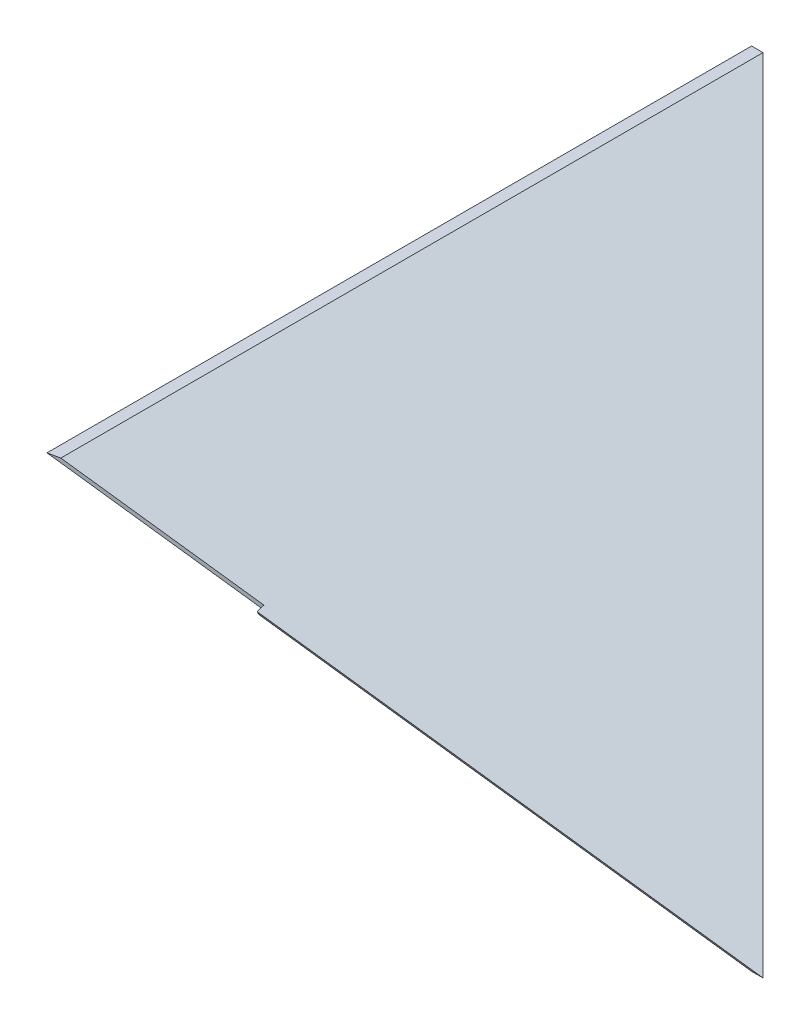
ISO-10303-21;
HEADER;
FILE_DESCRIPTION(('STEP AP214'),'2;1');
FILE_NAME('part.step','',(''),(''),'','','');
FILE_SCHEMA(('AUTOMOTIVE_DESIGN { 1 0 10303 214 1 1 1 1 }'));
ENDSEC;
DATA;
#1=APPLICATION_CONTEXT('core data for automotive mechanical design processes');
#2=APPLICATION_PROTOCOL_DEFINITION('international standard','automotive_design',2000,#1);
#3=PRODUCT_CONTEXT('',#1,'mechanical');
#4=PRODUCT('Part','Part','',(#3));
#5=PRODUCT_RELATED_PRODUCT_CATEGORY('part','',(#4));
#6=PRODUCT_DEFINITION_FORMATION('','',#4);
#7=PRODUCT_DEFINITION_CONTEXT('part definition',#1,'design');
#8=PRODUCT_DEFINITION('design','',#6,#7);
#9=PRODUCT_DEFINITION_SHAPE('','',#8);
#10=(LENGTH_UNIT() NAMED_UNIT(*) SI_UNIT(.MILLI.,.METRE.));
#11=(NAMED_UNIT(*) PLANE_ANGLE_UNIT() SI_UNIT($,.RADIAN.));
#12=(NAMED_UNIT(*) SI_UNIT($,.STERADIAN.) SOLID_ANGLE_UNIT());
#13=UNCERTAINTY_MEASURE_WITH_UNIT(LENGTH_MEASURE(1.E-05),#10,'distance_accuracy_value','');
#14=(GEOMETRIC_REPRESENTATION_CONTEXT(3) GLOBAL_UNCERTAINTY_ASSIGNED_CONTEXT((#13)) GLOBAL_UNIT_ASSIGNED_CONTEXT((#10,
#11,#12)) REPRESENTATION_CONTEXT('',''));
#15=CARTESIAN_POINT('',(0.,0.,0.));
#16=DIRECTION('',(0.,0.,1.));
#17=DIRECTION('',(1.,0.,0.));
#18=AXIS2_PLACEMENT_3D('',#15,#16,#17);
#19=CARTESIAN_POINT('',(304.8,-59.3053290170354,162.940052327635));
#20=DIRECTION('',(0.,0.939692620785911,0.342020143325663));
#21=DIRECTION('',(0.,-0.342020143325663,0.939692620785911));
#22=AXIS2_PLACEMENT_3D('',#19,#20,#21);
#23=PLANE('',#22);
#24=DIRECTION('',(-1.,0.,0.));
#25=VECTOR('',#24,1.);
#26=CARTESIAN_POINT('',(304.8,0.,0.));
#27=LINE('',#26,#25);
#28=CARTESIAN_POINT('',(3.17500000000007,0.,-6.E-06));
#29=VERTEX_POINT('',#28);
#30=CARTESIAN_POINT('',(0.,0.,0.));
#31=VERTEX_POINT('',#30);
#32=EDGE_CURVE('E104',#29,#31,#27,.T.);
#33=ORIENTED_EDGE('',*,*,#32,.F.);
#34=DIRECTION('',(0.684791078771737,-0.24924356936395,0.684791078771736));
#35=VECTOR('',#34,1.);
#36=CARTESIAN_POINT('',(231.149808257967,-82.9760443684434,227.974808257967));
#37=LINE('',#36,#35);
#38=CARTESIAN_POINT('',(166.115052327635,-59.3053290170354,162.940052327635));
#39=VERTEX_POINT('',#38);
#40=EDGE_CURVE('E106',#29,#39,#37,.T.);
#41=ORIENTED_EDGE('',*,*,#40,.T.);
#42=DIRECTION('',(-1.,0.,0.));
#43=VECTOR('',#42,1.);
#44=CARTESIAN_POINT('',(304.8,-59.3053290170354,162.940052327635));
#45=LINE('',#44,#43);
#46=CARTESIAN_POINT('',(162.940052327635,-59.3053290170354,162.940052327635));
#47=VERTEX_POINT('',#46);
#48=EDGE_CURVE('E105',#39,#47,#45,.T.);
#49=ORIENTED_EDGE('',*,*,#48,.T.);
#50=DIRECTION('',(-0.684791078771737,0.24924356936395,-0.684791078771736));
#51=VECTOR('',#50,1.);
#52=CARTESIAN_POINT('',(229.463689016437,-83.5179526468981,229.463689016437));
#53=LINE('',#52,#51);
#54=EDGE_CURVE('E110',#47,#31,#53,.T.);
#55=ORIENTED_EDGE('',*,*,#54,.T.);
#56=EDGE_LOOP('',(#33,#41,#49,#55));
#57=FACE_BOUND('',#56,.T.);
#58=ADVANCED_FACE('F34',(#57),#23,.F.);
#59=CARTESIAN_POINT('',(304.8,0.,0.));
#60=DIRECTION('',(0.,-1.,0.));
#61=DIRECTION('',(0.,0.,-1.));
#62=AXIS2_PLACEMENT_3D('',#59,#60,#61);
#63=PLANE('',#62);
#64=DIRECTION('',(0.,0.,1.));
#65=VECTOR('',#64,1.);
#66=CARTESIAN_POINT('',(0.,0.,0.));
#67=LINE('',#66,#65);
#68=CARTESIAN_POINT('',(0.,0.,195.413931332238));
#69=VERTEX_POINT('',#68);
#70=EDGE_CURVE('E95',#31,#69,#67,.T.);
#71=ORIENTED_EDGE('',*,*,#70,.T.);
#72=DIRECTION('',(-0.978626263746878,0.,0.205646871857623));
#73=VECTOR('',#72,1.);
#74=CARTESIAN_POINT('',(49.7142141983414,0.,184.967070241871));
#75=LINE('',#74,#73);
#76=CARTESIAN_POINT('',(3.17499999999987,0.,194.746742189319));
#77=VERTEX_POINT('',#76);
#78=EDGE_CURVE('E80',#77,#69,#75,.T.);
#79=ORIENTED_EDGE('',*,*,#78,.F.);
#80=DIRECTION('',(0.,0.,-1.));
#81=VECTOR('',#80,1.);
#82=CARTESIAN_POINT('',(3.17500000000007,0.,197.18));
#83=LINE('',#82,#81);
#84=EDGE_CURVE('E99',#77,#29,#83,.T.);
#85=ORIENTED_EDGE('',*,*,#84,.T.);
#86=ORIENTED_EDGE('',*,*,#32,.T.);
#87=EDGE_LOOP('',(#71,#79,#85,#86));
#88=FACE_BOUND('',#87,.T.);
#89=ADVANCED_FACE('F102',(#88),#63,.F.);
#90=CARTESIAN_POINT('',(304.8,0.,197.18));
#91=DIRECTION('',(0.,0.500000000000004,-0.866025403784436));
#92=DIRECTION('',(0.,0.866025403784436,0.500000000000005));
#93=AXIS2_PLACEMENT_3D('',#90,#91,#92);
#94=PLANE('',#93);
#95=DIRECTION('',(-0.92189103304376,0.335540895264842,0.193724626205287));
#96=VECTOR('',#95,1.);
#97=CARTESIAN_POINT('',(259.520983041758,-93.3023075009067,143.311887648338));
#98=LINE('',#97,#96);
#99=CARTESIAN_POINT('',(50.2039108119524,-17.1171236855104,187.297424032418));
#100=VERTEX_POINT('',#99);
#101=EDGE_CURVE('E55',#39,#100,#98,.T.);
#102=ORIENTED_EDGE('',*,*,#101,.T.);
#103=DIRECTION('',(-0.104493957523866,-0.861284366298812,-0.497262760731441));
#104=VECTOR('',#103,1.);
#105=CARTESIAN_POINT('',(55.0378745335579,22.7264948292113,210.301147907382));
#106=LINE('',#105,#104);
#107=CARTESIAN_POINT('',(50.0696380429546,-18.2238578881178,186.658450742622));
#108=VERTEX_POINT('',#107);
#109=EDGE_CURVE('E48',#100,#108,#106,.T.);
#110=ORIENTED_EDGE('',*,*,#109,.T.);
#111=DIRECTION('',(0.92189103304376,-0.335540895264842,-0.193724626205287));
#112=VECTOR('',#111,1.);
#113=CARTESIAN_POINT('',(259.044361810618,-94.2844370535478,142.744854886741));
#114=LINE('',#113,#112);
#115=EDGE_CURVE('E120',#108,#47,#114,.T.);
#116=ORIENTED_EDGE('',*,*,#115,.T.);
#117=ORIENTED_EDGE('',*,*,#48,.F.);
#118=EDGE_LOOP('',(#102,#110,#116,#117));
#119=FACE_BOUND('',#118,.T.);
#120=ADVANCED_FACE('F128',(#119),#94,.F.);
#121=CARTESIAN_POINT('',(0.,0.,-1.2E-05));
#122=DIRECTION('',(0.342020143325663,0.939692620785911,0.));
#123=DIRECTION('',(-0.939692620785911,0.342020143325663,0.));
#124=AXIS2_PLACEMENT_3D('',#121,#122,#123);
#125=PLANE('',#124);
#126=DIRECTION('',(-0.205073220657107,0.0746405481642905,-0.975896389346254));
#127=VECTOR('',#126,1.);
#128=CARTESIAN_POINT('',(10.3290111914083,-3.75945262307506,-2.4580713001439));
#129=LINE('',#128,#127);
#130=CARTESIAN_POINT('',(49.7142141983414,-18.0944941881301,184.967070241871));
#131=VERTEX_POINT('',#130);
#132=EDGE_CURVE('E98',#108,#131,#129,.T.);
#133=ORIENTED_EDGE('',*,*,#132,.T.);
#134=DIRECTION('',(-0.921891033043759,0.335540895264842,0.193724626205288));
#135=VECTOR('',#134,1.);
#136=CARTESIAN_POINT('',(34.8995615565767,-12.7024015955348,188.080196351702));
#137=LINE('',#136,#135);
#138=EDGE_CURVE('E84',#131,#69,#137,.T.);
#139=ORIENTED_EDGE('',*,*,#138,.T.);
#140=ORIENTED_EDGE('',*,*,#70,.F.);
#141=ORIENTED_EDGE('',*,*,#54,.F.);
#142=ORIENTED_EDGE('',*,*,#115,.F.);
#143=EDGE_LOOP('',(#133,#139,#140,#141,#142));
#144=FACE_BOUND('',#143,.T.);
#145=ADVANCED_FACE('F93',(#144),#125,.F.);
#146=CARTESIAN_POINT('',(166.115052327635,-59.3053290170354,-1.2E-05));
#147=DIRECTION('',(-0.342020143325663,-0.939692620785911,0.));
#148=DIRECTION('',(0.939692620785911,-0.342020143325663,0.));
#149=AXIS2_PLACEMENT_3D('',#146,#147,#148);
#150=PLANE('',#149);
#151=ORIENTED_EDGE('',*,*,#84,.F.);
#152=DIRECTION('',(0.921891033043759,-0.335540895264842,-0.193724626205288));
#153=VECTOR('',#152,1.);
#154=CARTESIAN_POINT('',(194.780443746323,-69.7386782470276,154.483097530468));
#155=LINE('',#154,#153);
#156=CARTESIAN_POINT('',(49.7142141983414,-16.938888694335,184.967070241871));
#157=VERTEX_POINT('',#156);
#158=EDGE_CURVE('E11',#77,#157,#155,.T.);
#159=ORIENTED_EDGE('',*,*,#158,.T.);
#160=DIRECTION('',(0.205073220657107,-0.0746405481642905,0.975896389346254));
#161=VECTOR('',#160,1.);
#162=CARTESIAN_POINT('',(18.2404460861784,-5.48337394131115,35.1906315564012));
#163=LINE('',#162,#161);
#164=EDGE_CURVE('E41',#157,#100,#163,.T.);
#165=ORIENTED_EDGE('',*,*,#164,.T.);
#166=ORIENTED_EDGE('',*,*,#101,.F.);
#167=ORIENTED_EDGE('',*,*,#40,.F.);
#168=EDGE_LOOP('',(#151,#159,#165,#166,#167));
#169=FACE_BOUND('',#168,.T.);
#170=ADVANCED_FACE('F131',(#169),#150,.F.);
#171=CARTESIAN_POINT('',(49.7142141983414,-59.3053540170354,184.967070241871));
#172=DIRECTION('',(-0.205646871857623,0.,-0.978626263746878));
#173=DIRECTION('',(-0.978626263746878,0.,0.205646871857623));
#174=AXIS2_PLACEMENT_3D('',#171,#172,#173);
#175=PLANE('',#174);
#176=DIRECTION('',(0.,1.,0.));
#177=VECTOR('',#176,1.);
#178=CARTESIAN_POINT('',(49.7142141983414,-59.3053540170354,184.967070241871));
#179=LINE('',#178,#177);
#180=EDGE_CURVE('E89',#131,#157,#179,.T.);
#181=ORIENTED_EDGE('',*,*,#180,.T.);
#182=ORIENTED_EDGE('',*,*,#158,.F.);
#183=ORIENTED_EDGE('',*,*,#78,.T.);
#184=ORIENTED_EDGE('',*,*,#138,.F.);
#185=EDGE_LOOP('',(#181,#182,#183,#184));
#186=FACE_BOUND('',#185,.T.);
#187=ADVANCED_FACE('F83',(#186),#175,.F.);
#188=CARTESIAN_POINT('',(50.2039108119524,-59.3053540170354,187.297424032418));
#189=DIRECTION('',(0.978626263746878,0.,-0.205646871857621));
#190=DIRECTION('',(-0.205646871857621,0.,-0.978626263746879));
#191=AXIS2_PLACEMENT_3D('',#188,#189,#190);
#192=PLANE('',#191);
#193=ORIENTED_EDGE('',*,*,#109,.F.);
#194=ORIENTED_EDGE('',*,*,#164,.F.);
#195=ORIENTED_EDGE('',*,*,#180,.F.);
#196=ORIENTED_EDGE('',*,*,#132,.F.);
#197=EDGE_LOOP('',(#193,#194,#195,#196));
#198=FACE_BOUND('',#197,.T.);
#199=ADVANCED_FACE('F132',(#198),#192,.F.);
#200=CLOSED_SHELL('',(#58,#89,#120,#145,#170,#187,#199));
#201=MANIFOLD_SOLID_BREP('B2',#200);
#202=ADVANCED_BREP_SHAPE_REPRESENTATION('',(#18,#201),#14);
#203=SHAPE_DEFINITION_REPRESENTATION(#9,#202);
ENDSEC;
END-ISO-10303-21;
